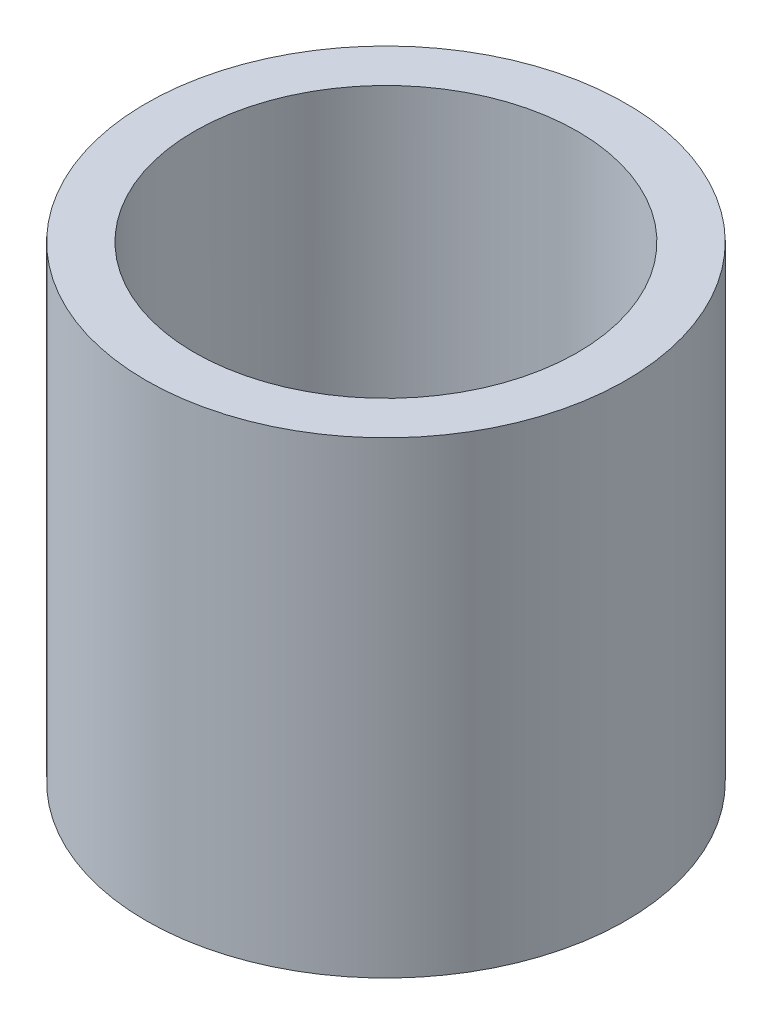
ISO-10303-21;
HEADER;
FILE_DESCRIPTION(('STEP AP214'),'2;1');
FILE_NAME('part.step','',(''),(''),'','','');
FILE_SCHEMA(('AUTOMOTIVE_DESIGN { 1 0 10303 214 1 1 1 1 }'));
ENDSEC;
DATA;
#1=APPLICATION_CONTEXT('core data for automotive mechanical design processes');
#2=APPLICATION_PROTOCOL_DEFINITION('international standard','automotive_design',2000,#1);
#3=PRODUCT_CONTEXT('',#1,'mechanical');
#4=PRODUCT('Part','Part','',(#3));
#5=PRODUCT_RELATED_PRODUCT_CATEGORY('part','',(#4));
#6=PRODUCT_DEFINITION_FORMATION('','',#4);
#7=PRODUCT_DEFINITION_CONTEXT('part definition',#1,'design');
#8=PRODUCT_DEFINITION('design','',#6,#7);
#9=PRODUCT_DEFINITION_SHAPE('','',#8);
#10=(LENGTH_UNIT() NAMED_UNIT(*) SI_UNIT(.MILLI.,.METRE.));
#11=(NAMED_UNIT(*) PLANE_ANGLE_UNIT() SI_UNIT($,.RADIAN.));
#12=(NAMED_UNIT(*) SI_UNIT($,.STERADIAN.) SOLID_ANGLE_UNIT());
#13=UNCERTAINTY_MEASURE_WITH_UNIT(LENGTH_MEASURE(1.E-05),#10,'distance_accuracy_value','');
#14=(GEOMETRIC_REPRESENTATION_CONTEXT(3) GLOBAL_UNCERTAINTY_ASSIGNED_CONTEXT((#13)) GLOBAL_UNIT_ASSIGNED_CONTEXT((#10,
#11,#12)) REPRESENTATION_CONTEXT('',''));
#15=CARTESIAN_POINT('',(0.,0.,0.));
#16=DIRECTION('',(0.,0.,1.));
#17=DIRECTION('',(1.,0.,0.));
#18=AXIS2_PLACEMENT_3D('',#15,#16,#17);
#19=CARTESIAN_POINT('',(0.,39.087,0.));
#20=DIRECTION('',(0.,-1.,0.));
#21=DIRECTION('',(0.254469098778032,0.,-0.967080905491933));
#22=AXIS2_PLACEMENT_3D('',#19,#20,#21);
#23=CYLINDRICAL_SURFACE('',#22,15.972775);
#24=CARTESIAN_POINT('',(0.,10.,0.));
#25=DIRECTION('',(0.,1.,0.));
#26=DIRECTION('',(0.,0.,1.));
#27=AXIS2_PLACEMENT_3D('',#24,#25,#26);
#28=CIRCLE('',#27,15.972775);
#29=CARTESIAN_POINT('',(4.0645776592343,10.,-15.4469657102189));
#30=VERTEX_POINT('',#29);
#31=EDGE_CURVE('E10',#30,#30,#28,.T.);
#32=CARTESIAN_POINT('',(0.,39.,0.));
#33=DIRECTION('',(0.,1.,0.));
#34=DIRECTION('',(0.,0.,1.));
#35=AXIS2_PLACEMENT_3D('',#32,#33,#34);
#36=CIRCLE('',#35,15.972775);
#37=CARTESIAN_POINT('',(4.0645776592343,39.,-15.4469657102189));
#38=VERTEX_POINT('',#37);
#39=EDGE_CURVE('E55',#38,#38,#36,.F.);
#40=CARTESIAN_POINT('',(4.0645776592343,10.,-15.4469657102189));
#41=CARTESIAN_POINT('',(4.0645776592343,10.3020833333333,-15.4469657102189));
#42=CARTESIAN_POINT('',(4.0645776592343,10.6041666666667,-15.4469657102189));
#43=CARTESIAN_POINT('',(4.0645776592343,11.2083333333333,-15.4469657102189));
#44=CARTESIAN_POINT('',(4.0645776592343,11.5104166666667,-15.4469657102189));
#45=CARTESIAN_POINT('',(4.0645776592343,12.1145833333333,-15.4469657102189));
#46=CARTESIAN_POINT('',(4.0645776592343,12.4166666666667,-15.4469657102189));
#47=CARTESIAN_POINT('',(4.0645776592343,13.0208333333333,-15.4469657102189));
#48=CARTESIAN_POINT('',(4.0645776592343,13.3229166666667,-15.4469657102189));
#49=CARTESIAN_POINT('',(4.0645776592343,13.9270833333333,-15.4469657102189));
#50=CARTESIAN_POINT('',(4.0645776592343,14.2291666666667,-15.4469657102189));
#51=CARTESIAN_POINT('',(4.0645776592343,14.8333333333333,-15.4469657102189));
#52=CARTESIAN_POINT('',(4.0645776592343,15.1354166666667,-15.4469657102189));
#53=CARTESIAN_POINT('',(4.0645776592343,15.7395833333333,-15.4469657102189));
#54=CARTESIAN_POINT('',(4.0645776592343,16.0416666666667,-15.4469657102189));
#55=CARTESIAN_POINT('',(4.0645776592343,16.6458333333333,-15.4469657102189));
#56=CARTESIAN_POINT('',(4.0645776592343,16.9479166666667,-15.4469657102189));
#57=CARTESIAN_POINT('',(4.0645776592343,17.5520833333333,-15.4469657102189));
#58=CARTESIAN_POINT('',(4.0645776592343,17.8541666666667,-15.4469657102189));
#59=CARTESIAN_POINT('',(4.0645776592343,18.4583333333333,-15.4469657102189));
#60=CARTESIAN_POINT('',(4.0645776592343,18.7604166666667,-15.4469657102189));
#61=CARTESIAN_POINT('',(4.0645776592343,19.3645833333333,-15.4469657102189));
#62=CARTESIAN_POINT('',(4.0645776592343,19.6666666666667,-15.4469657102189));
#63=CARTESIAN_POINT('',(4.0645776592343,20.2708333333333,-15.4469657102189));
#64=CARTESIAN_POINT('',(4.0645776592343,20.5729166666667,-15.4469657102189));
#65=CARTESIAN_POINT('',(4.0645776592343,21.1770833333333,-15.4469657102189));
#66=CARTESIAN_POINT('',(4.0645776592343,21.4791666666667,-15.4469657102189));
#67=CARTESIAN_POINT('',(4.0645776592343,22.0833333333333,-15.4469657102189));
#68=CARTESIAN_POINT('',(4.0645776592343,22.3854166666667,-15.4469657102189));
#69=CARTESIAN_POINT('',(4.0645776592343,22.9895833333333,-15.4469657102189));
#70=CARTESIAN_POINT('',(4.0645776592343,23.2916666666667,-15.4469657102189));
#71=CARTESIAN_POINT('',(4.0645776592343,23.8958333333333,-15.4469657102189));
#72=CARTESIAN_POINT('',(4.0645776592343,24.1979166666667,-15.4469657102189));
#73=CARTESIAN_POINT('',(4.0645776592343,24.8020833333333,-15.4469657102189));
#74=CARTESIAN_POINT('',(4.0645776592343,25.1041666666667,-15.4469657102189));
#75=CARTESIAN_POINT('',(4.0645776592343,25.7083333333333,-15.4469657102189));
#76=CARTESIAN_POINT('',(4.0645776592343,26.0104166666667,-15.4469657102189));
#77=CARTESIAN_POINT('',(4.0645776592343,26.6145833333333,-15.4469657102189));
#78=CARTESIAN_POINT('',(4.0645776592343,26.9166666666667,-15.4469657102189));
#79=CARTESIAN_POINT('',(4.0645776592343,27.5208333333333,-15.4469657102189));
#80=CARTESIAN_POINT('',(4.0645776592343,27.8229166666667,-15.4469657102189));
#81=CARTESIAN_POINT('',(4.0645776592343,28.4270833333333,-15.4469657102189));
#82=CARTESIAN_POINT('',(4.0645776592343,28.7291666666667,-15.4469657102189));
#83=CARTESIAN_POINT('',(4.0645776592343,29.3333333333333,-15.4469657102189));
#84=CARTESIAN_POINT('',(4.0645776592343,29.6354166666667,-15.4469657102189));
#85=CARTESIAN_POINT('',(4.0645776592343,30.2395833333333,-15.4469657102189));
#86=CARTESIAN_POINT('',(4.0645776592343,30.5416666666667,-15.4469657102189));
#87=CARTESIAN_POINT('',(4.0645776592343,31.1458333333333,-15.4469657102189));
#88=CARTESIAN_POINT('',(4.0645776592343,31.4479166666667,-15.4469657102189));
#89=CARTESIAN_POINT('',(4.0645776592343,32.0520833333333,-15.4469657102189));
#90=CARTESIAN_POINT('',(4.0645776592343,32.3541666666667,-15.4469657102189));
#91=CARTESIAN_POINT('',(4.0645776592343,32.9583333333333,-15.4469657102189));
#92=CARTESIAN_POINT('',(4.0645776592343,33.2604166666667,-15.4469657102189));
#93=CARTESIAN_POINT('',(4.0645776592343,33.8645833333333,-15.4469657102189));
#94=CARTESIAN_POINT('',(4.0645776592343,34.1666666666667,-15.4469657102189));
#95=CARTESIAN_POINT('',(4.0645776592343,34.7708333333333,-15.4469657102189));
#96=CARTESIAN_POINT('',(4.0645776592343,35.0729166666667,-15.4469657102189));
#97=CARTESIAN_POINT('',(4.0645776592343,35.6770833333333,-15.4469657102189));
#98=CARTESIAN_POINT('',(4.0645776592343,35.9791666666667,-15.4469657102189));
#99=CARTESIAN_POINT('',(4.0645776592343,36.5833333333333,-15.4469657102189));
#100=CARTESIAN_POINT('',(4.0645776592343,36.8854166666667,-15.4469657102189));
#101=CARTESIAN_POINT('',(4.0645776592343,37.4895833333333,-15.4469657102189));
#102=CARTESIAN_POINT('',(4.0645776592343,37.7916666666667,-15.4469657102189));
#103=CARTESIAN_POINT('',(4.0645776592343,38.3958333333333,-15.4469657102189));
#104=CARTESIAN_POINT('',(4.0645776592343,38.6979166666667,-15.4469657102189));
#105=CARTESIAN_POINT('',(4.0645776592343,39.,-15.4469657102189));
#106=B_SPLINE_CURVE_WITH_KNOTS('',3,(#40,#41,#42,#43,#44,#45,#46,#47,#48,#49,#50,#51,#52,#53,
#54,#55,#56,#57,#58,#59,#60,#61,#62,#63,#64,#65,#66,#67,#68,#69,#70,#71,#72,#73,#74,#75,#76,#77,
#78,#79,#80,#81,#82,#83,#84,#85,#86,#87,#88,#89,#90,#91,#92,#93,#94,#95,#96,#97,#98,#99,#100,
#101,#102,#103,#104,#105),.UNSPECIFIED.,.F.,.F.,(4,2,2,2,2,2,2,2,2,2,2,2,2,2,2,2,2,2,2,2,2,2,2,
2,2,2,2,2,2,2,2,2,4),(0.,0.906250000000001,1.8125,2.71875,3.625,4.53125,5.4375,6.34375,7.25,
8.15625,9.0625,9.96875,10.875,11.78125,12.6875,13.59375,14.5,15.40625,16.3125,17.21875,18.125,
19.03125,19.9375,20.84375,21.75,22.65625,23.5625,24.46875,25.375,26.28125,27.1875,28.09375,29.),.UNSPECIFIED.);
#107=EDGE_CURVE('BSEAM35',#30,#38,#106,.T.);
#108=ORIENTED_EDGE('',*,*,#31,.F.);
#109=ORIENTED_EDGE('',*,*,#39,.F.);
#110=ORIENTED_EDGE('',*,*,#107,.T.);
#111=ORIENTED_EDGE('',*,*,#107,.F.);
#112=EDGE_LOOP('',(#108,#110,#109,#111));
#113=FACE_BOUND('',#112,.T.);
#114=ADVANCED_FACE('F35',(#113),#23,.F.);
#115=CARTESIAN_POINT('',(0.,39.,0.));
#116=DIRECTION('',(0.,-1.,0.));
#117=DIRECTION('',(0.,0.,-1.));
#118=AXIS2_PLACEMENT_3D('',#115,#116,#117);
#119=CYLINDRICAL_SURFACE('',#118,20.);
#120=CARTESIAN_POINT('',(0.,39.,0.));
#121=DIRECTION('',(0.,1.,0.));
#122=DIRECTION('',(0.,0.,1.));
#123=AXIS2_PLACEMENT_3D('',#120,#121,#122);
#124=CIRCLE('',#123,20.);
#125=CARTESIAN_POINT('',(0.,39.,20.));
#126=VERTEX_POINT('',#125);
#127=EDGE_CURVE('E43',#126,#126,#124,.T.);
#128=ORIENTED_EDGE('',*,*,#127,.F.);
#129=EDGE_LOOP('',(#128));
#130=FACE_BOUND('',#129,.T.);
#131=CARTESIAN_POINT('',(0.,0.,0.));
#132=DIRECTION('',(0.,1.,0.));
#133=DIRECTION('',(0.,0.,1.));
#134=AXIS2_PLACEMENT_3D('',#131,#132,#133);
#135=CIRCLE('',#134,20.);
#136=CARTESIAN_POINT('',(0.,0.,20.));
#137=VERTEX_POINT('',#136);
#138=EDGE_CURVE('E50',#137,#137,#135,.T.);
#139=ORIENTED_EDGE('',*,*,#138,.T.);
#140=EDGE_LOOP('',(#139));
#141=FACE_BOUND('',#140,.T.);
#142=ADVANCED_FACE('F37',(#130,#141),#119,.T.);
#143=CARTESIAN_POINT('',(0.,39.,0.));
#144=DIRECTION('',(0.,1.,0.));
#145=DIRECTION('',(0.,0.,1.));
#146=AXIS2_PLACEMENT_3D('',#143,#144,#145);
#147=PLANE('',#146);
#148=ORIENTED_EDGE('',*,*,#127,.T.);
#149=EDGE_LOOP('',(#148));
#150=FACE_BOUND('',#149,.T.);
#151=ORIENTED_EDGE('',*,*,#39,.T.);
#152=EDGE_LOOP('',(#151));
#153=FACE_BOUND('',#152,.T.);
#154=ADVANCED_FACE('F70',(#150,#153),#147,.T.);
#155=CARTESIAN_POINT('',(0.,0.,0.));
#156=DIRECTION('',(0.,1.,0.));
#157=DIRECTION('',(0.,0.,1.));
#158=AXIS2_PLACEMENT_3D('',#155,#156,#157);
#159=PLANE('',#158);
#160=ORIENTED_EDGE('',*,*,#138,.F.);
#161=EDGE_LOOP('',(#160));
#162=FACE_BOUND('',#161,.T.);
#163=CARTESIAN_POINT('',(0.,0.,0.));
#164=DIRECTION('',(0.,-1.,0.));
#165=DIRECTION('',(0.,0.,-1.));
#166=AXIS2_PLACEMENT_3D('',#163,#164,#165);
#167=CIRCLE('',#166,15.0978883647408);
#168=CARTESIAN_POINT('',(0.,0.,-15.0978883647408));
#169=VERTEX_POINT('',#168);
#170=EDGE_CURVE('E58',#169,#169,#167,.T.);
#171=ORIENTED_EDGE('',*,*,#170,.F.);
#172=EDGE_LOOP('',(#171));
#173=FACE_BOUND('',#172,.T.);
#174=ADVANCED_FACE('F68',(#162,#173),#159,.F.);
#175=CARTESIAN_POINT('',(0.,10.,0.));
#176=DIRECTION('',(0.,1.,0.));
#177=DIRECTION('',(0.,0.,-1.));
#178=AXIS2_PLACEMENT_3D('',#175,#176,#177);
#179=CONICAL_SURFACE('',#178,15.972775,0.0872664625997167);
#180=ORIENTED_EDGE('',*,*,#170,.T.);
#181=EDGE_LOOP('',(#180));
#182=FACE_BOUND('',#181,.T.);
#183=ORIENTED_EDGE('',*,*,#31,.T.);
#184=EDGE_LOOP('',(#183));
#185=FACE_BOUND('',#184,.T.);
#186=ADVANCED_FACE('F66',(#182,#185),#179,.F.);
#187=CLOSED_SHELL('',(#114,#142,#154,#174,#186));
#188=MANIFOLD_SOLID_BREP('B2',#187);
#189=ADVANCED_BREP_SHAPE_REPRESENTATION('',(#18,#188),#14);
#190=SHAPE_DEFINITION_REPRESENTATION(#9,#189);
ENDSEC;
END-ISO-10303-21;
